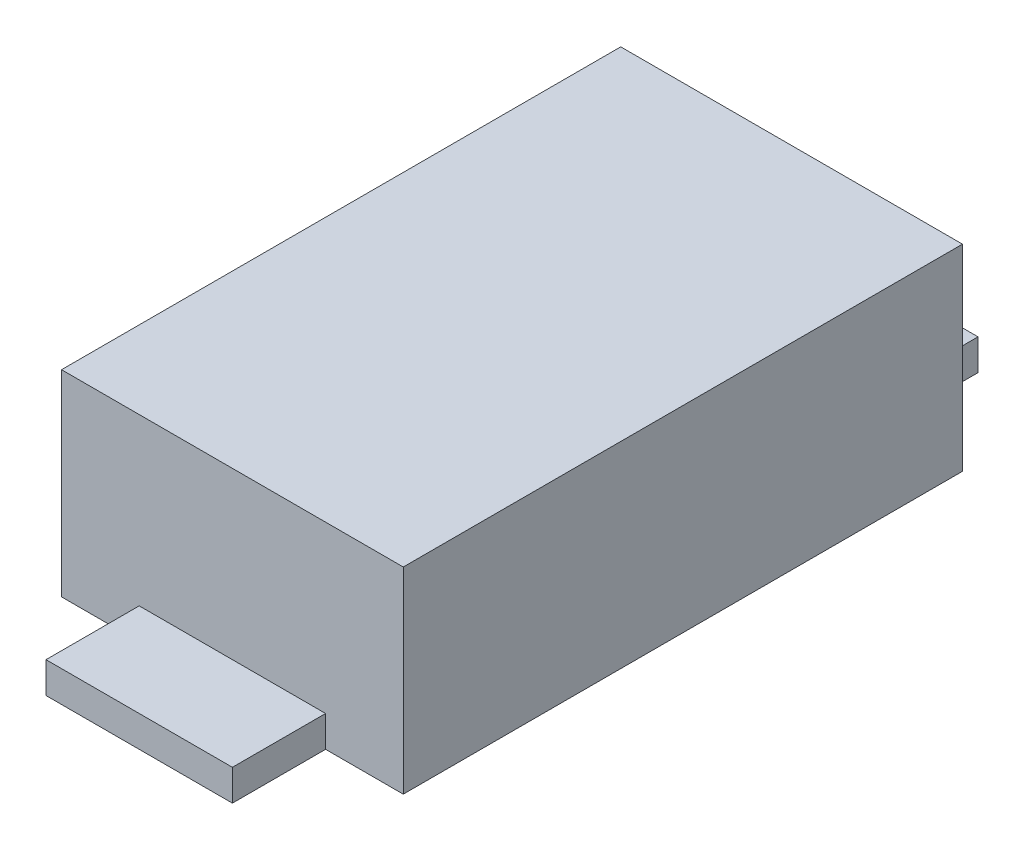
ISO-10303-21;
HEADER;
FILE_DESCRIPTION(('STEP AP214'),'2;1');
FILE_NAME('part.step','',(''),(''),'','','');
FILE_SCHEMA(('AUTOMOTIVE_DESIGN { 1 0 10303 214 1 1 1 1 }'));
ENDSEC;
DATA;
#1=APPLICATION_CONTEXT('core data for automotive mechanical design processes');
#2=APPLICATION_PROTOCOL_DEFINITION('international standard','automotive_design',2000,#1);
#3=PRODUCT_CONTEXT('',#1,'mechanical');
#4=PRODUCT('Part','Part','',(#3));
#5=PRODUCT_RELATED_PRODUCT_CATEGORY('part','',(#4));
#6=PRODUCT_DEFINITION_FORMATION('','',#4);
#7=PRODUCT_DEFINITION_CONTEXT('part definition',#1,'design');
#8=PRODUCT_DEFINITION('design','',#6,#7);
#9=PRODUCT_DEFINITION_SHAPE('','',#8);
#10=(LENGTH_UNIT() NAMED_UNIT(*) SI_UNIT(.MILLI.,.METRE.));
#11=(NAMED_UNIT(*) PLANE_ANGLE_UNIT() SI_UNIT($,.RADIAN.));
#12=(NAMED_UNIT(*) SI_UNIT($,.STERADIAN.) SOLID_ANGLE_UNIT());
#13=UNCERTAINTY_MEASURE_WITH_UNIT(LENGTH_MEASURE(1.E-05),#10,'distance_accuracy_value','');
#14=(GEOMETRIC_REPRESENTATION_CONTEXT(3) GLOBAL_UNCERTAINTY_ASSIGNED_CONTEXT((#13)) GLOBAL_UNIT_ASSIGNED_CONTEXT((#10,
#11,#12)) REPRESENTATION_CONTEXT('',''));
#15=CARTESIAN_POINT('',(0.,0.,0.));
#16=DIRECTION('',(0.,0.,1.));
#17=DIRECTION('',(1.,0.,0.));
#18=AXIS2_PLACEMENT_3D('',#15,#16,#17);
#19=CARTESIAN_POINT('',(-0.825,0.95,1.35));
#20=DIRECTION('',(0.,0.,-1.));
#21=DIRECTION('',(-1.,0.,0.));
#22=AXIS2_PLACEMENT_3D('',#19,#20,#21);
#23=PLANE('',#22);
#24=DIRECTION('',(0.,-1.,0.));
#25=VECTOR('',#24,1.);
#26=CARTESIAN_POINT('',(-0.45,0.15,1.35));
#27=LINE('',#26,#25);
#28=CARTESIAN_POINT('',(-0.45,0.15,1.35));
#29=VERTEX_POINT('',#28);
#30=CARTESIAN_POINT('',(-0.45,0.,1.35));
#31=VERTEX_POINT('',#30);
#32=EDGE_CURVE('E155',#29,#31,#27,.T.);
#33=ORIENTED_EDGE('',*,*,#32,.F.);
#34=DIRECTION('',(1.,0.,0.));
#35=VECTOR('',#34,1.);
#36=CARTESIAN_POINT('',(-0.45,0.15,1.35));
#37=LINE('',#36,#35);
#38=CARTESIAN_POINT('',(0.45,0.15,1.35));
#39=VERTEX_POINT('',#38);
#40=EDGE_CURVE('E146',#29,#39,#37,.T.);
#41=ORIENTED_EDGE('',*,*,#40,.T.);
#42=DIRECTION('',(0.,-1.,0.));
#43=VECTOR('',#42,1.);
#44=CARTESIAN_POINT('',(0.45,0.15,1.35));
#45=LINE('',#44,#43);
#46=CARTESIAN_POINT('',(0.45,0.,1.35));
#47=VERTEX_POINT('',#46);
#48=EDGE_CURVE('E161',#39,#47,#45,.T.);
#49=ORIENTED_EDGE('',*,*,#48,.T.);
#50=DIRECTION('',(1.,0.,0.));
#51=VECTOR('',#50,1.);
#52=CARTESIAN_POINT('',(-0.825,0.,1.35));
#53=LINE('',#52,#51);
#54=CARTESIAN_POINT('',(0.825,0.,1.35));
#55=VERTEX_POINT('',#54);
#56=EDGE_CURVE('E206',#47,#55,#53,.T.);
#57=ORIENTED_EDGE('',*,*,#56,.T.);
#58=DIRECTION('',(0.,-1.,0.));
#59=VECTOR('',#58,1.);
#60=CARTESIAN_POINT('',(0.825,0.95,1.35));
#61=LINE('',#60,#59);
#62=CARTESIAN_POINT('',(0.825,0.95,1.35));
#63=VERTEX_POINT('',#62);
#64=EDGE_CURVE('E197',#63,#55,#61,.T.);
#65=ORIENTED_EDGE('',*,*,#64,.F.);
#66=DIRECTION('',(1.,0.,0.));
#67=VECTOR('',#66,1.);
#68=CARTESIAN_POINT('',(-0.825,0.95,1.35));
#69=LINE('',#68,#67);
#70=CARTESIAN_POINT('',(-0.825,0.95,1.35));
#71=VERTEX_POINT('',#70);
#72=EDGE_CURVE('E195',#71,#63,#69,.T.);
#73=ORIENTED_EDGE('',*,*,#72,.F.);
#74=DIRECTION('',(0.,-1.,0.));
#75=VECTOR('',#74,1.);
#76=CARTESIAN_POINT('',(-0.825,0.95,1.35));
#77=LINE('',#76,#75);
#78=CARTESIAN_POINT('',(-0.825,0.,1.35));
#79=VERTEX_POINT('',#78);
#80=EDGE_CURVE('E211',#71,#79,#77,.T.);
#81=ORIENTED_EDGE('',*,*,#80,.T.);
#82=EDGE_CURVE('E191',#79,#31,#53,.T.);
#83=ORIENTED_EDGE('',*,*,#82,.T.);
#84=EDGE_LOOP('',(#33,#41,#49,#57,#65,#73,#81,#83));
#85=FACE_BOUND('',#84,.T.);
#86=ADVANCED_FACE('F36',(#85),#23,.F.);
#87=CARTESIAN_POINT('',(-0.825000000000001,0.95,-1.35));
#88=DIRECTION('',(0.,0.,1.));
#89=DIRECTION('',(1.,0.,0.));
#90=AXIS2_PLACEMENT_3D('',#87,#88,#89);
#91=PLANE('',#90);
#92=DIRECTION('',(0.,-1.,0.));
#93=VECTOR('',#92,1.);
#94=CARTESIAN_POINT('',(0.45,0.15,-1.35));
#95=LINE('',#94,#93);
#96=CARTESIAN_POINT('',(0.45,0.15,-1.35));
#97=VERTEX_POINT('',#96);
#98=CARTESIAN_POINT('',(0.45,0.,-1.35));
#99=VERTEX_POINT('',#98);
#100=EDGE_CURVE('E182',#97,#99,#95,.T.);
#101=ORIENTED_EDGE('',*,*,#100,.F.);
#102=DIRECTION('',(1.,0.,0.));
#103=VECTOR('',#102,1.);
#104=CARTESIAN_POINT('',(-0.45,0.15,-1.35));
#105=LINE('',#104,#103);
#106=CARTESIAN_POINT('',(-0.45,0.15,-1.35));
#107=VERTEX_POINT('',#106);
#108=EDGE_CURVE('E166',#107,#97,#105,.T.);
#109=ORIENTED_EDGE('',*,*,#108,.F.);
#110=DIRECTION('',(0.,-1.,0.));
#111=VECTOR('',#110,1.);
#112=CARTESIAN_POINT('',(-0.45,0.15,-1.35));
#113=LINE('',#112,#111);
#114=CARTESIAN_POINT('',(-0.45,0.,-1.35));
#115=VERTEX_POINT('',#114);
#116=EDGE_CURVE('E184',#107,#115,#113,.T.);
#117=ORIENTED_EDGE('',*,*,#116,.T.);
#118=DIRECTION('',(-1.,0.,0.));
#119=VECTOR('',#118,1.);
#120=CARTESIAN_POINT('',(-0.825000000000001,0.,-1.35));
#121=LINE('',#120,#119);
#122=CARTESIAN_POINT('',(-0.825000000000001,0.,-1.35));
#123=VERTEX_POINT('',#122);
#124=EDGE_CURVE('E200',#115,#123,#121,.T.);
#125=ORIENTED_EDGE('',*,*,#124,.T.);
#126=DIRECTION('',(0.,-1.,0.));
#127=VECTOR('',#126,1.);
#128=CARTESIAN_POINT('',(-0.825000000000001,0.95,-1.35));
#129=LINE('',#128,#127);
#130=CARTESIAN_POINT('',(-0.825000000000001,0.95,-1.35));
#131=VERTEX_POINT('',#130);
#132=EDGE_CURVE('E44',#131,#123,#129,.T.);
#133=ORIENTED_EDGE('',*,*,#132,.F.);
#134=DIRECTION('',(-1.,0.,0.));
#135=VECTOR('',#134,1.);
#136=CARTESIAN_POINT('',(-0.825000000000001,0.95,-1.35));
#137=LINE('',#136,#135);
#138=CARTESIAN_POINT('',(0.824999999999999,0.95,-1.35));
#139=VERTEX_POINT('',#138);
#140=EDGE_CURVE('E190',#139,#131,#137,.T.);
#141=ORIENTED_EDGE('',*,*,#140,.F.);
#142=DIRECTION('',(0.,-1.,0.));
#143=VECTOR('',#142,1.);
#144=CARTESIAN_POINT('',(0.824999999999999,0.95,-1.35));
#145=LINE('',#144,#143);
#146=CARTESIAN_POINT('',(0.824999999999999,0.,-1.35));
#147=VERTEX_POINT('',#146);
#148=EDGE_CURVE('E11',#139,#147,#145,.T.);
#149=ORIENTED_EDGE('',*,*,#148,.T.);
#150=EDGE_CURVE('E201',#147,#99,#121,.T.);
#151=ORIENTED_EDGE('',*,*,#150,.T.);
#152=EDGE_LOOP('',(#101,#109,#117,#125,#133,#141,#149,#151));
#153=FACE_BOUND('',#152,.T.);
#154=ADVANCED_FACE('F234',(#153),#91,.F.);
#155=CARTESIAN_POINT('',(0.824999999999999,0.95,-1.35));
#156=DIRECTION('',(-1.,0.,0.));
#157=DIRECTION('',(0.,0.,1.));
#158=AXIS2_PLACEMENT_3D('',#155,#156,#157);
#159=PLANE('',#158);
#160=DIRECTION('',(0.,0.,-1.));
#161=VECTOR('',#160,1.);
#162=CARTESIAN_POINT('',(0.824999999999999,0.,-1.35));
#163=LINE('',#162,#161);
#164=EDGE_CURVE('E186',#55,#147,#163,.T.);
#165=ORIENTED_EDGE('',*,*,#164,.T.);
#166=ORIENTED_EDGE('',*,*,#148,.F.);
#167=DIRECTION('',(0.,0.,-1.));
#168=VECTOR('',#167,1.);
#169=CARTESIAN_POINT('',(0.824999999999999,0.95,-1.35));
#170=LINE('',#169,#168);
#171=EDGE_CURVE('E187',#63,#139,#170,.T.);
#172=ORIENTED_EDGE('',*,*,#171,.F.);
#173=ORIENTED_EDGE('',*,*,#64,.T.);
#174=EDGE_LOOP('',(#165,#166,#172,#173));
#175=FACE_BOUND('',#174,.T.);
#176=ADVANCED_FACE('F38',(#175),#159,.F.);
#177=CARTESIAN_POINT('',(-0.825000000000001,0.95,-1.35));
#178=DIRECTION('',(1.,0.,0.));
#179=DIRECTION('',(0.,0.,-1.));
#180=AXIS2_PLACEMENT_3D('',#177,#178,#179);
#181=PLANE('',#180);
#182=DIRECTION('',(0.,0.,1.));
#183=VECTOR('',#182,1.);
#184=CARTESIAN_POINT('',(-0.825000000000001,0.,-1.35));
#185=LINE('',#184,#183);
#186=EDGE_CURVE('E204',#123,#79,#185,.T.);
#187=ORIENTED_EDGE('',*,*,#186,.T.);
#188=ORIENTED_EDGE('',*,*,#80,.F.);
#189=DIRECTION('',(0.,0.,1.));
#190=VECTOR('',#189,1.);
#191=CARTESIAN_POINT('',(-0.825000000000001,0.95,-1.35));
#192=LINE('',#191,#190);
#193=EDGE_CURVE('E193',#131,#71,#192,.T.);
#194=ORIENTED_EDGE('',*,*,#193,.F.);
#195=ORIENTED_EDGE('',*,*,#132,.T.);
#196=EDGE_LOOP('',(#187,#188,#194,#195));
#197=FACE_BOUND('',#196,.T.);
#198=ADVANCED_FACE('F218',(#197),#181,.F.);
#199=CARTESIAN_POINT('',(0.,0.95,0.));
#200=DIRECTION('',(0.,1.,0.));
#201=DIRECTION('',(0.,0.,1.));
#202=AXIS2_PLACEMENT_3D('',#199,#200,#201);
#203=PLANE('',#202);
#204=ORIENTED_EDGE('',*,*,#171,.T.);
#205=ORIENTED_EDGE('',*,*,#140,.T.);
#206=ORIENTED_EDGE('',*,*,#193,.T.);
#207=ORIENTED_EDGE('',*,*,#72,.T.);
#208=EDGE_LOOP('',(#204,#205,#206,#207));
#209=FACE_BOUND('',#208,.T.);
#210=ADVANCED_FACE('F231',(#209),#203,.T.);
#211=CARTESIAN_POINT('',(0.,0.,0.));
#212=DIRECTION('',(0.,1.,0.));
#213=DIRECTION('',(0.,0.,1.));
#214=AXIS2_PLACEMENT_3D('',#211,#212,#213);
#215=PLANE('',#214);
#216=ORIENTED_EDGE('',*,*,#164,.F.);
#217=ORIENTED_EDGE('',*,*,#56,.F.);
#218=DIRECTION('',(0.,0.,1.));
#219=VECTOR('',#218,1.);
#220=CARTESIAN_POINT('',(0.45,0.,1.35));
#221=LINE('',#220,#219);
#222=CARTESIAN_POINT('',(0.45,0.,1.8));
#223=VERTEX_POINT('',#222);
#224=EDGE_CURVE('E51',#47,#223,#221,.T.);
#225=ORIENTED_EDGE('',*,*,#224,.T.);
#226=DIRECTION('',(-1.,0.,0.));
#227=VECTOR('',#226,1.);
#228=CARTESIAN_POINT('',(-0.45,0.,1.8));
#229=LINE('',#228,#227);
#230=CARTESIAN_POINT('',(-0.45,0.,1.8));
#231=VERTEX_POINT('',#230);
#232=EDGE_CURVE('E157',#223,#231,#229,.T.);
#233=ORIENTED_EDGE('',*,*,#232,.T.);
#234=DIRECTION('',(0.,0.,-1.));
#235=VECTOR('',#234,1.);
#236=CARTESIAN_POINT('',(-0.45,0.,1.35));
#237=LINE('',#236,#235);
#238=EDGE_CURVE('E132',#231,#31,#237,.T.);
#239=ORIENTED_EDGE('',*,*,#238,.T.);
#240=ORIENTED_EDGE('',*,*,#82,.F.);
#241=ORIENTED_EDGE('',*,*,#186,.F.);
#242=ORIENTED_EDGE('',*,*,#124,.F.);
#243=DIRECTION('',(0.,0.,1.));
#244=VECTOR('',#243,1.);
#245=CARTESIAN_POINT('',(-0.45,0.,-1.35));
#246=LINE('',#245,#244);
#247=CARTESIAN_POINT('',(-0.45,0.,-1.8));
#248=VERTEX_POINT('',#247);
#249=EDGE_CURVE('E59',#248,#115,#246,.T.);
#250=ORIENTED_EDGE('',*,*,#249,.F.);
#251=DIRECTION('',(-1.,0.,0.));
#252=VECTOR('',#251,1.);
#253=CARTESIAN_POINT('',(-0.45,0.,-1.8));
#254=LINE('',#253,#252);
#255=CARTESIAN_POINT('',(0.45,0.,-1.8));
#256=VERTEX_POINT('',#255);
#257=EDGE_CURVE('E167',#256,#248,#254,.T.);
#258=ORIENTED_EDGE('',*,*,#257,.F.);
#259=DIRECTION('',(0.,0.,-1.));
#260=VECTOR('',#259,1.);
#261=CARTESIAN_POINT('',(0.45,0.,-1.35));
#262=LINE('',#261,#260);
#263=EDGE_CURVE('E175',#99,#256,#262,.T.);
#264=ORIENTED_EDGE('',*,*,#263,.F.);
#265=ORIENTED_EDGE('',*,*,#150,.F.);
#266=EDGE_LOOP('',(#216,#217,#225,#233,#239,#240,#241,#242,#250,#258,#264,#265));
#267=FACE_BOUND('',#266,.T.);
#268=ADVANCED_FACE('F225',(#267),#215,.F.);
#269=CARTESIAN_POINT('',(-0.45,0.15,-1.35));
#270=DIRECTION('',(1.,0.,0.));
#271=DIRECTION('',(0.,0.,-1.));
#272=AXIS2_PLACEMENT_3D('',#269,#270,#271);
#273=PLANE('',#272);
#274=ORIENTED_EDGE('',*,*,#249,.T.);
#275=ORIENTED_EDGE('',*,*,#116,.F.);
#276=DIRECTION('',(0.,0.,1.));
#277=VECTOR('',#276,1.);
#278=CARTESIAN_POINT('',(-0.45,0.15,-1.35));
#279=LINE('',#278,#277);
#280=CARTESIAN_POINT('',(-0.45,0.15,-1.8));
#281=VERTEX_POINT('',#280);
#282=EDGE_CURVE('E164',#281,#107,#279,.T.);
#283=ORIENTED_EDGE('',*,*,#282,.F.);
#284=DIRECTION('',(0.,-1.,0.));
#285=VECTOR('',#284,1.);
#286=CARTESIAN_POINT('',(-0.45,0.15,-1.8));
#287=LINE('',#286,#285);
#288=EDGE_CURVE('E173',#281,#248,#287,.T.);
#289=ORIENTED_EDGE('',*,*,#288,.T.);
#290=EDGE_LOOP('',(#274,#275,#283,#289));
#291=FACE_BOUND('',#290,.T.);
#292=ADVANCED_FACE('F251',(#291),#273,.F.);
#293=CARTESIAN_POINT('',(0.45,0.15,-1.35));
#294=DIRECTION('',(-1.,0.,0.));
#295=DIRECTION('',(0.,0.,1.));
#296=AXIS2_PLACEMENT_3D('',#293,#294,#295);
#297=PLANE('',#296);
#298=ORIENTED_EDGE('',*,*,#263,.T.);
#299=DIRECTION('',(0.,-1.,0.));
#300=VECTOR('',#299,1.);
#301=CARTESIAN_POINT('',(0.45,0.15,-1.8));
#302=LINE('',#301,#300);
#303=CARTESIAN_POINT('',(0.45,0.15,-1.8));
#304=VERTEX_POINT('',#303);
#305=EDGE_CURVE('E179',#304,#256,#302,.T.);
#306=ORIENTED_EDGE('',*,*,#305,.F.);
#307=DIRECTION('',(0.,0.,-1.));
#308=VECTOR('',#307,1.);
#309=CARTESIAN_POINT('',(0.45,0.15,-1.35));
#310=LINE('',#309,#308);
#311=EDGE_CURVE('E169',#97,#304,#310,.T.);
#312=ORIENTED_EDGE('',*,*,#311,.F.);
#313=ORIENTED_EDGE('',*,*,#100,.T.);
#314=EDGE_LOOP('',(#298,#306,#312,#313));
#315=FACE_BOUND('',#314,.T.);
#316=ADVANCED_FACE('F241',(#315),#297,.F.);
#317=CARTESIAN_POINT('',(-0.45,0.15,-1.8));
#318=DIRECTION('',(0.,0.,1.));
#319=DIRECTION('',(1.,0.,0.));
#320=AXIS2_PLACEMENT_3D('',#317,#318,#319);
#321=PLANE('',#320);
#322=ORIENTED_EDGE('',*,*,#257,.T.);
#323=ORIENTED_EDGE('',*,*,#288,.F.);
#324=DIRECTION('',(-1.,0.,0.));
#325=VECTOR('',#324,1.);
#326=CARTESIAN_POINT('',(-0.45,0.15,-1.8));
#327=LINE('',#326,#325);
#328=EDGE_CURVE('E171',#304,#281,#327,.T.);
#329=ORIENTED_EDGE('',*,*,#328,.F.);
#330=ORIENTED_EDGE('',*,*,#305,.T.);
#331=EDGE_LOOP('',(#322,#323,#329,#330));
#332=FACE_BOUND('',#331,.T.);
#333=ADVANCED_FACE('F245',(#332),#321,.F.);
#334=CARTESIAN_POINT('',(0.,0.15,0.));
#335=DIRECTION('',(0.,-1.,0.));
#336=DIRECTION('',(0.,0.,-1.));
#337=AXIS2_PLACEMENT_3D('',#334,#335,#336);
#338=PLANE('',#337);
#339=ORIENTED_EDGE('',*,*,#282,.T.);
#340=ORIENTED_EDGE('',*,*,#108,.T.);
#341=ORIENTED_EDGE('',*,*,#311,.T.);
#342=ORIENTED_EDGE('',*,*,#328,.T.);
#343=EDGE_LOOP('',(#339,#340,#341,#342));
#344=FACE_BOUND('',#343,.T.);
#345=ADVANCED_FACE('F249',(#344),#338,.F.);
#346=CARTESIAN_POINT('',(-0.45,0.15,1.35));
#347=DIRECTION('',(-1.,0.,0.));
#348=DIRECTION('',(0.,0.,1.));
#349=AXIS2_PLACEMENT_3D('',#346,#347,#348);
#350=PLANE('',#349);
#351=ORIENTED_EDGE('',*,*,#238,.F.);
#352=DIRECTION('',(0.,-1.,0.));
#353=VECTOR('',#352,1.);
#354=CARTESIAN_POINT('',(-0.45,0.15,1.8));
#355=LINE('',#354,#353);
#356=CARTESIAN_POINT('',(-0.45,0.15,1.8));
#357=VERTEX_POINT('',#356);
#358=EDGE_CURVE('E126',#357,#231,#355,.T.);
#359=ORIENTED_EDGE('',*,*,#358,.F.);
#360=DIRECTION('',(0.,0.,-1.));
#361=VECTOR('',#360,1.);
#362=CARTESIAN_POINT('',(-0.45,0.15,1.35));
#363=LINE('',#362,#361);
#364=EDGE_CURVE('E129',#357,#29,#363,.T.);
#365=ORIENTED_EDGE('',*,*,#364,.T.);
#366=ORIENTED_EDGE('',*,*,#32,.T.);
#367=EDGE_LOOP('',(#351,#359,#365,#366));
#368=FACE_BOUND('',#367,.T.);
#369=ADVANCED_FACE('F128',(#368),#350,.T.);
#370=CARTESIAN_POINT('',(-0.45,0.15,1.8));
#371=DIRECTION('',(0.,0.,1.));
#372=DIRECTION('',(1.,0.,0.));
#373=AXIS2_PLACEMENT_3D('',#370,#371,#372);
#374=PLANE('',#373);
#375=ORIENTED_EDGE('',*,*,#232,.F.);
#376=DIRECTION('',(0.,-1.,0.));
#377=VECTOR('',#376,1.);
#378=CARTESIAN_POINT('',(0.45,0.15,1.8));
#379=LINE('',#378,#377);
#380=CARTESIAN_POINT('',(0.45,0.15,1.8));
#381=VERTEX_POINT('',#380);
#382=EDGE_CURVE('E137',#381,#223,#379,.T.);
#383=ORIENTED_EDGE('',*,*,#382,.F.);
#384=DIRECTION('',(-1.,0.,0.));
#385=VECTOR('',#384,1.);
#386=CARTESIAN_POINT('',(-0.45,0.15,1.8));
#387=LINE('',#386,#385);
#388=EDGE_CURVE('E143',#381,#357,#387,.T.);
#389=ORIENTED_EDGE('',*,*,#388,.T.);
#390=ORIENTED_EDGE('',*,*,#358,.T.);
#391=EDGE_LOOP('',(#375,#383,#389,#390));
#392=FACE_BOUND('',#391,.T.);
#393=ADVANCED_FACE('F149',(#392),#374,.T.);
#394=CARTESIAN_POINT('',(0.45,0.15,1.35));
#395=DIRECTION('',(1.,0.,0.));
#396=DIRECTION('',(0.,0.,-1.));
#397=AXIS2_PLACEMENT_3D('',#394,#395,#396);
#398=PLANE('',#397);
#399=ORIENTED_EDGE('',*,*,#224,.F.);
#400=ORIENTED_EDGE('',*,*,#48,.F.);
#401=DIRECTION('',(0.,0.,1.));
#402=VECTOR('',#401,1.);
#403=CARTESIAN_POINT('',(0.45,0.15,1.35));
#404=LINE('',#403,#402);
#405=EDGE_CURVE('E150',#39,#381,#404,.T.);
#406=ORIENTED_EDGE('',*,*,#405,.T.);
#407=ORIENTED_EDGE('',*,*,#382,.T.);
#408=EDGE_LOOP('',(#399,#400,#406,#407));
#409=FACE_BOUND('',#408,.T.);
#410=ADVANCED_FACE('F340',(#409),#398,.T.);
#411=CARTESIAN_POINT('',(0.,0.15,0.));
#412=DIRECTION('',(0.,-1.,0.));
#413=DIRECTION('',(0.,0.,1.));
#414=AXIS2_PLACEMENT_3D('',#411,#412,#413);
#415=PLANE('',#414);
#416=ORIENTED_EDGE('',*,*,#364,.F.);
#417=ORIENTED_EDGE('',*,*,#388,.F.);
#418=ORIENTED_EDGE('',*,*,#405,.F.);
#419=ORIENTED_EDGE('',*,*,#40,.F.);
#420=EDGE_LOOP('',(#416,#417,#418,#419));
#421=FACE_BOUND('',#420,.T.);
#422=ADVANCED_FACE('F141',(#421),#415,.F.);
#423=CLOSED_SHELL('',(#86,#154,#176,#198,#210,#268,#292,#316,#333,#345,#369,#393,#410,#422));
#424=MANIFOLD_SOLID_BREP('B2',#423);
#425=ADVANCED_BREP_SHAPE_REPRESENTATION('',(#18,#424),#14);
#426=SHAPE_DEFINITION_REPRESENTATION(#9,#425);
ENDSEC;
END-ISO-10303-21;
